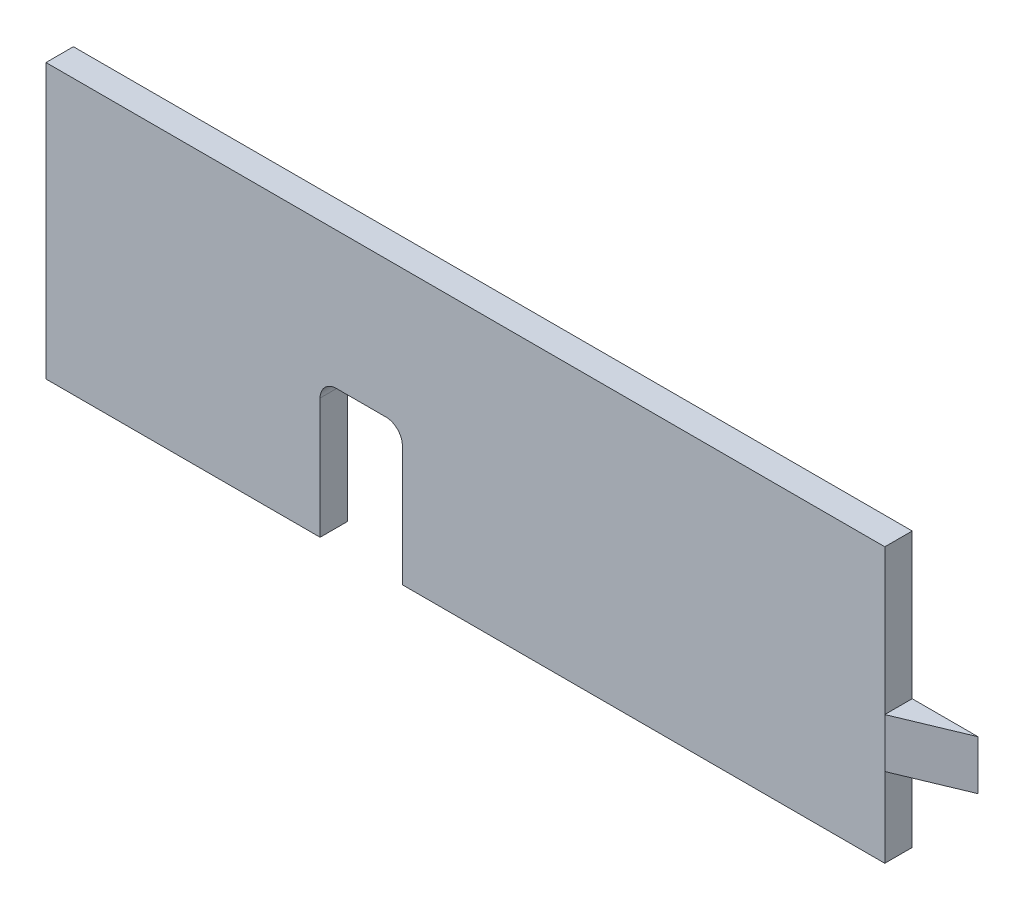
ISO-10303-21;
HEADER;
FILE_DESCRIPTION(('STEP AP214'),'2;1');
FILE_NAME('part.step','',(''),(''),'','','');
FILE_SCHEMA(('AUTOMOTIVE_DESIGN { 1 0 10303 214 1 1 1 1 }'));
ENDSEC;
DATA;
#1=APPLICATION_CONTEXT('core data for automotive mechanical design processes');
#2=APPLICATION_PROTOCOL_DEFINITION('international standard','automotive_design',2000,#1);
#3=PRODUCT_CONTEXT('',#1,'mechanical');
#4=PRODUCT('Part','Part','',(#3));
#5=PRODUCT_RELATED_PRODUCT_CATEGORY('part','',(#4));
#6=PRODUCT_DEFINITION_FORMATION('','',#4);
#7=PRODUCT_DEFINITION_CONTEXT('part definition',#1,'design');
#8=PRODUCT_DEFINITION('design','',#6,#7);
#9=PRODUCT_DEFINITION_SHAPE('','',#8);
#10=(LENGTH_UNIT() NAMED_UNIT(*) SI_UNIT(.MILLI.,.METRE.));
#11=(NAMED_UNIT(*) PLANE_ANGLE_UNIT() SI_UNIT($,.RADIAN.));
#12=(NAMED_UNIT(*) SI_UNIT($,.STERADIAN.) SOLID_ANGLE_UNIT());
#13=UNCERTAINTY_MEASURE_WITH_UNIT(LENGTH_MEASURE(1.E-05),#10,'distance_accuracy_value','');
#14=(GEOMETRIC_REPRESENTATION_CONTEXT(3) GLOBAL_UNCERTAINTY_ASSIGNED_CONTEXT((#13)) GLOBAL_UNIT_ASSIGNED_CONTEXT((#10,
#11,#12)) REPRESENTATION_CONTEXT('',''));
#15=CARTESIAN_POINT('',(0.,0.,0.));
#16=DIRECTION('',(0.,0.,1.));
#17=DIRECTION('',(1.,0.,0.));
#18=AXIS2_PLACEMENT_3D('',#15,#16,#17);
#19=CARTESIAN_POINT('',(76.5,-25.,2.5));
#20=DIRECTION('',(-1.,0.,0.));
#21=DIRECTION('',(0.,0.,1.));
#22=AXIS2_PLACEMENT_3D('',#19,#20,#21);
#23=PLANE('',#22);
#24=DIRECTION('',(0.,0.,1.));
#25=VECTOR('',#24,1.);
#26=CARTESIAN_POINT('',(76.5,-1.5,2.5));
#27=LINE('',#26,#25);
#28=CARTESIAN_POINT('',(76.5,-1.5,-2.5));
#29=VERTEX_POINT('',#28);
#30=CARTESIAN_POINT('',(76.5,-1.5,2.5));
#31=VERTEX_POINT('',#30);
#32=EDGE_CURVE('E47',#29,#31,#27,.T.);
#33=ORIENTED_EDGE('',*,*,#32,.F.);
#34=DIRECTION('',(0.,1.,0.));
#35=VECTOR('',#34,1.);
#36=CARTESIAN_POINT('',(76.5,-25.,-2.5));
#37=LINE('',#36,#35);
#38=CARTESIAN_POINT('',(76.5,25.,-2.5));
#39=VERTEX_POINT('',#38);
#40=EDGE_CURVE('E176',#29,#39,#37,.T.);
#41=ORIENTED_EDGE('',*,*,#40,.T.);
#42=DIRECTION('',(0.,0.,-1.));
#43=VECTOR('',#42,1.);
#44=CARTESIAN_POINT('',(76.5,25.,2.5));
#45=LINE('',#44,#43);
#46=CARTESIAN_POINT('',(76.5,25.,2.5));
#47=VERTEX_POINT('',#46);
#48=EDGE_CURVE('E11',#47,#39,#45,.T.);
#49=ORIENTED_EDGE('',*,*,#48,.F.);
#50=DIRECTION('',(0.,1.,0.));
#51=VECTOR('',#50,1.);
#52=CARTESIAN_POINT('',(76.5,-25.,2.5));
#53=LINE('',#52,#51);
#54=EDGE_CURVE('E160',#31,#47,#53,.T.);
#55=ORIENTED_EDGE('',*,*,#54,.F.);
#56=EDGE_LOOP('',(#33,#41,#49,#55));
#57=FACE_BOUND('',#56,.T.);
#58=ADVANCED_FACE('F33',(#57),#23,.F.);
#59=DIRECTION('',(0.,0.,-1.));
#60=VECTOR('',#59,1.);
#61=CARTESIAN_POINT('',(76.5,-10.5,2.5));
#62=LINE('',#61,#60);
#63=CARTESIAN_POINT('',(76.5,-10.5,2.5));
#64=VERTEX_POINT('',#63);
#65=CARTESIAN_POINT('',(76.5,-10.5,-2.5));
#66=VERTEX_POINT('',#65);
#67=EDGE_CURVE('E141',#64,#66,#62,.T.);
#68=ORIENTED_EDGE('',*,*,#67,.F.);
#69=CARTESIAN_POINT('',(76.5,-25.,2.5));
#70=VERTEX_POINT('',#69);
#71=EDGE_CURVE('E150',#70,#64,#53,.T.);
#72=ORIENTED_EDGE('',*,*,#71,.F.);
#73=DIRECTION('',(0.,0.,-1.));
#74=VECTOR('',#73,1.);
#75=CARTESIAN_POINT('',(76.5,-25.,2.5));
#76=LINE('',#75,#74);
#77=CARTESIAN_POINT('',(76.5,-25.,-2.5));
#78=VERTEX_POINT('',#77);
#79=EDGE_CURVE('E173',#70,#78,#76,.T.);
#80=ORIENTED_EDGE('',*,*,#79,.T.);
#81=EDGE_CURVE('E152',#78,#66,#37,.T.);
#82=ORIENTED_EDGE('',*,*,#81,.T.);
#83=EDGE_LOOP('',(#68,#72,#80,#82));
#84=FACE_BOUND('',#83,.T.);
#85=ADVANCED_FACE('F148',(#84),#23,.F.);
#86=CARTESIAN_POINT('',(-76.5,-25.,2.5));
#87=DIRECTION('',(0.,1.,0.));
#88=DIRECTION('',(0.,0.,1.));
#89=AXIS2_PLACEMENT_3D('',#86,#87,#88);
#90=PLANE('',#89);
#91=DIRECTION('',(1.,0.,0.));
#92=VECTOR('',#91,1.);
#93=CARTESIAN_POINT('',(-76.5,-25.,-2.5));
#94=LINE('',#93,#92);
#95=CARTESIAN_POINT('',(-76.5,-25.,-2.5));
#96=VERTEX_POINT('',#95);
#97=CARTESIAN_POINT('',(-26.5,-25.,-2.5));
#98=VERTEX_POINT('',#97);
#99=EDGE_CURVE('E164',#96,#98,#94,.T.);
#100=ORIENTED_EDGE('',*,*,#99,.T.);
#101=DIRECTION('',(0.,0.,1.));
#102=VECTOR('',#101,1.);
#103=CARTESIAN_POINT('',(-26.5,-25.,-2.5));
#104=LINE('',#103,#102);
#105=CARTESIAN_POINT('',(-26.5,-25.,2.5));
#106=VERTEX_POINT('',#105);
#107=EDGE_CURVE('E207',#98,#106,#104,.T.);
#108=ORIENTED_EDGE('',*,*,#107,.T.);
#109=DIRECTION('',(1.,0.,0.));
#110=VECTOR('',#109,1.);
#111=CARTESIAN_POINT('',(-76.5,-25.,2.5));
#112=LINE('',#111,#110);
#113=CARTESIAN_POINT('',(-76.5,-25.,2.5));
#114=VERTEX_POINT('',#113);
#115=EDGE_CURVE('E170',#114,#106,#112,.T.);
#116=ORIENTED_EDGE('',*,*,#115,.F.);
#117=DIRECTION('',(0.,0.,-1.));
#118=VECTOR('',#117,1.);
#119=CARTESIAN_POINT('',(-76.5,-25.,2.5));
#120=LINE('',#119,#118);
#121=EDGE_CURVE('E184',#114,#96,#120,.T.);
#122=ORIENTED_EDGE('',*,*,#121,.T.);
#123=EDGE_LOOP('',(#100,#108,#116,#122));
#124=FACE_BOUND('',#123,.T.);
#125=ADVANCED_FACE('F205',(#124),#90,.F.);
#126=CARTESIAN_POINT('',(-76.5,25.,2.5));
#127=DIRECTION('',(0.,-1.,0.));
#128=DIRECTION('',(0.,0.,-1.));
#129=AXIS2_PLACEMENT_3D('',#126,#127,#128);
#130=PLANE('',#129);
#131=DIRECTION('',(-1.,0.,0.));
#132=VECTOR('',#131,1.);
#133=CARTESIAN_POINT('',(-76.5,25.,-2.5));
#134=LINE('',#133,#132);
#135=CARTESIAN_POINT('',(-76.5,25.,-2.5));
#136=VERTEX_POINT('',#135);
#137=EDGE_CURVE('E175',#39,#136,#134,.T.);
#138=ORIENTED_EDGE('',*,*,#137,.T.);
#139=DIRECTION('',(0.,0.,-1.));
#140=VECTOR('',#139,1.);
#141=CARTESIAN_POINT('',(-76.5,25.,2.5));
#142=LINE('',#141,#140);
#143=CARTESIAN_POINT('',(-76.5,25.,2.5));
#144=VERTEX_POINT('',#143);
#145=EDGE_CURVE('E40',#144,#136,#142,.T.);
#146=ORIENTED_EDGE('',*,*,#145,.F.);
#147=DIRECTION('',(-1.,0.,0.));
#148=VECTOR('',#147,1.);
#149=CARTESIAN_POINT('',(-76.5,25.,2.5));
#150=LINE('',#149,#148);
#151=EDGE_CURVE('E159',#47,#144,#150,.T.);
#152=ORIENTED_EDGE('',*,*,#151,.F.);
#153=ORIENTED_EDGE('',*,*,#48,.T.);
#154=EDGE_LOOP('',(#138,#146,#152,#153));
#155=FACE_BOUND('',#154,.T.);
#156=ADVANCED_FACE('F212',(#155),#130,.F.);
#157=CARTESIAN_POINT('',(-76.5,-25.,2.5));
#158=DIRECTION('',(1.,0.,0.));
#159=DIRECTION('',(0.,0.,-1.));
#160=AXIS2_PLACEMENT_3D('',#157,#158,#159);
#161=PLANE('',#160);
#162=DIRECTION('',(0.,-1.,0.));
#163=VECTOR('',#162,1.);
#164=CARTESIAN_POINT('',(-76.5,-25.,-2.5));
#165=LINE('',#164,#163);
#166=EDGE_CURVE('E178',#136,#96,#165,.T.);
#167=ORIENTED_EDGE('',*,*,#166,.T.);
#168=ORIENTED_EDGE('',*,*,#121,.F.);
#169=DIRECTION('',(0.,-1.,0.));
#170=VECTOR('',#169,1.);
#171=CARTESIAN_POINT('',(-76.5,-25.,2.5));
#172=LINE('',#171,#170);
#173=EDGE_CURVE('E162',#144,#114,#172,.T.);
#174=ORIENTED_EDGE('',*,*,#173,.F.);
#175=ORIENTED_EDGE('',*,*,#145,.T.);
#176=EDGE_LOOP('',(#167,#168,#174,#175));
#177=FACE_BOUND('',#176,.T.);
#178=ADVANCED_FACE('F191',(#177),#161,.F.);
#179=CARTESIAN_POINT('',(-11.5,-25.,2.5));
#180=VERTEX_POINT('',#179);
#181=EDGE_CURVE('E157',#180,#70,#112,.T.);
#182=ORIENTED_EDGE('',*,*,#181,.F.);
#183=DIRECTION('',(0.,0.,1.));
#184=VECTOR('',#183,1.);
#185=CARTESIAN_POINT('',(-11.5,-25.,-2.5));
#186=LINE('',#185,#184);
#187=CARTESIAN_POINT('',(-11.5,-25.,-2.5));
#188=VERTEX_POINT('',#187);
#189=EDGE_CURVE('E166',#188,#180,#186,.T.);
#190=ORIENTED_EDGE('',*,*,#189,.F.);
#191=EDGE_CURVE('E180',#188,#78,#94,.T.);
#192=ORIENTED_EDGE('',*,*,#191,.T.);
#193=ORIENTED_EDGE('',*,*,#79,.F.);
#194=EDGE_LOOP('',(#182,#190,#192,#193));
#195=FACE_BOUND('',#194,.T.);
#196=ADVANCED_FACE('F277',(#195),#90,.F.);
#197=CARTESIAN_POINT('',(0.,0.,2.5));
#198=DIRECTION('',(0.,0.,-1.));
#199=DIRECTION('',(-1.,0.,0.));
#200=AXIS2_PLACEMENT_3D('',#197,#198,#199);
#201=PLANE('',#200);
#202=ORIENTED_EDGE('',*,*,#71,.T.);
#203=DIRECTION('',(0.,-1.,0.));
#204=VECTOR('',#203,1.);
#205=CARTESIAN_POINT('',(76.5,11.5,2.5));
#206=LINE('',#205,#204);
#207=EDGE_CURVE('E127',#31,#64,#206,.T.);
#208=ORIENTED_EDGE('',*,*,#207,.F.);
#209=ORIENTED_EDGE('',*,*,#54,.T.);
#210=ORIENTED_EDGE('',*,*,#151,.T.);
#211=ORIENTED_EDGE('',*,*,#173,.T.);
#212=ORIENTED_EDGE('',*,*,#115,.T.);
#213=DIRECTION('',(0.,-1.,0.));
#214=VECTOR('',#213,1.);
#215=CARTESIAN_POINT('',(-26.5,-25.,2.5));
#216=LINE('',#215,#214);
#217=CARTESIAN_POINT('',(-26.5,-3.,2.5));
#218=VERTEX_POINT('',#217);
#219=EDGE_CURVE('E210',#218,#106,#216,.T.);
#220=ORIENTED_EDGE('',*,*,#219,.F.);
#221=CARTESIAN_POINT('',(-23.5,-3.,2.5));
#222=DIRECTION('',(0.,0.,1.));
#223=DIRECTION('',(-1.,0.,0.));
#224=AXIS2_PLACEMENT_3D('',#221,#222,#223);
#225=CIRCLE('',#224,3.);
#226=CARTESIAN_POINT('',(-23.5,0.,2.5));
#227=VERTEX_POINT('',#226);
#228=EDGE_CURVE('E241',#227,#218,#225,.T.);
#229=ORIENTED_EDGE('',*,*,#228,.F.);
#230=DIRECTION('',(-1.,0.,0.));
#231=VECTOR('',#230,1.);
#232=CARTESIAN_POINT('',(-23.5,0.,2.5));
#233=LINE('',#232,#231);
#234=CARTESIAN_POINT('',(-14.5,0.,2.5));
#235=VERTEX_POINT('',#234);
#236=EDGE_CURVE('E239',#235,#227,#233,.T.);
#237=ORIENTED_EDGE('',*,*,#236,.F.);
#238=CARTESIAN_POINT('',(-14.5,-3.,2.5));
#239=DIRECTION('',(0.,0.,1.));
#240=DIRECTION('',(-1.,0.,0.));
#241=AXIS2_PLACEMENT_3D('',#238,#239,#240);
#242=CIRCLE('',#241,3.);
#243=CARTESIAN_POINT('',(-11.5,-3.,2.5));
#244=VERTEX_POINT('',#243);
#245=EDGE_CURVE('E237',#244,#235,#242,.T.);
#246=ORIENTED_EDGE('',*,*,#245,.F.);
#247=DIRECTION('',(0.,1.,0.));
#248=VECTOR('',#247,1.);
#249=CARTESIAN_POINT('',(-11.5,-3.,2.5));
#250=LINE('',#249,#248);
#251=EDGE_CURVE('E235',#180,#244,#250,.T.);
#252=ORIENTED_EDGE('',*,*,#251,.F.);
#253=ORIENTED_EDGE('',*,*,#181,.T.);
#254=EDGE_LOOP('',(#202,#208,#209,#210,#211,#212,#220,#229,#237,#246,#252,#253));
#255=FACE_BOUND('',#254,.T.);
#256=ADVANCED_FACE('F154',(#255),#201,.F.);
#257=CARTESIAN_POINT('',(0.,0.,-2.5));
#258=DIRECTION('',(0.,0.,-1.));
#259=DIRECTION('',(-1.,0.,0.));
#260=AXIS2_PLACEMENT_3D('',#257,#258,#259);
#261=PLANE('',#260);
#262=DIRECTION('',(0.,-1.,0.));
#263=VECTOR('',#262,1.);
#264=CARTESIAN_POINT('',(-26.5,-25.,-2.5));
#265=LINE('',#264,#263);
#266=CARTESIAN_POINT('',(-26.5,-3.,-2.5));
#267=VERTEX_POINT('',#266);
#268=EDGE_CURVE('E202',#267,#98,#265,.T.);
#269=ORIENTED_EDGE('',*,*,#268,.T.);
#270=ORIENTED_EDGE('',*,*,#99,.F.);
#271=ORIENTED_EDGE('',*,*,#166,.F.);
#272=ORIENTED_EDGE('',*,*,#137,.F.);
#273=ORIENTED_EDGE('',*,*,#40,.F.);
#274=DIRECTION('',(-1.,0.,0.));
#275=VECTOR('',#274,1.);
#276=CARTESIAN_POINT('',(88.5,-1.5,-2.5));
#277=LINE('',#276,#275);
#278=CARTESIAN_POINT('',(88.5,-1.5,-2.5));
#279=VERTEX_POINT('',#278);
#280=EDGE_CURVE('E290',#279,#29,#277,.T.);
#281=ORIENTED_EDGE('',*,*,#280,.F.);
#282=DIRECTION('',(0.,1.,0.));
#283=VECTOR('',#282,1.);
#284=CARTESIAN_POINT('',(88.5,-10.5,-2.5));
#285=LINE('',#284,#283);
#286=CARTESIAN_POINT('',(88.5,-10.5,-2.5));
#287=VERTEX_POINT('',#286);
#288=EDGE_CURVE('E289',#287,#279,#285,.T.);
#289=ORIENTED_EDGE('',*,*,#288,.F.);
#290=DIRECTION('',(-1.,0.,0.));
#291=VECTOR('',#290,1.);
#292=CARTESIAN_POINT('',(88.5,-10.5,-2.5));
#293=LINE('',#292,#291);
#294=EDGE_CURVE('E143',#287,#66,#293,.T.);
#295=ORIENTED_EDGE('',*,*,#294,.T.);
#296=ORIENTED_EDGE('',*,*,#81,.F.);
#297=ORIENTED_EDGE('',*,*,#191,.F.);
#298=DIRECTION('',(0.,1.,0.));
#299=VECTOR('',#298,1.);
#300=CARTESIAN_POINT('',(-11.5,-3.,-2.5));
#301=LINE('',#300,#299);
#302=CARTESIAN_POINT('',(-11.5,-3.,-2.5));
#303=VERTEX_POINT('',#302);
#304=EDGE_CURVE('E244',#188,#303,#301,.T.);
#305=ORIENTED_EDGE('',*,*,#304,.T.);
#306=CARTESIAN_POINT('',(-14.5,-3.,-2.5));
#307=DIRECTION('',(0.,0.,1.));
#308=DIRECTION('',(-1.,0.,0.));
#309=AXIS2_PLACEMENT_3D('',#306,#307,#308);
#310=CIRCLE('',#309,3.);
#311=CARTESIAN_POINT('',(-14.5,0.,-2.5));
#312=VERTEX_POINT('',#311);
#313=EDGE_CURVE('E55',#303,#312,#310,.T.);
#314=ORIENTED_EDGE('',*,*,#313,.T.);
#315=DIRECTION('',(-1.,0.,0.));
#316=VECTOR('',#315,1.);
#317=CARTESIAN_POINT('',(-23.5,0.,-2.5));
#318=LINE('',#317,#316);
#319=CARTESIAN_POINT('',(-23.5,0.,-2.5));
#320=VERTEX_POINT('',#319);
#321=EDGE_CURVE('E231',#312,#320,#318,.T.);
#322=ORIENTED_EDGE('',*,*,#321,.T.);
#323=CARTESIAN_POINT('',(-23.5,-3.,-2.5));
#324=DIRECTION('',(0.,0.,1.));
#325=DIRECTION('',(-1.,0.,0.));
#326=AXIS2_PLACEMENT_3D('',#323,#324,#325);
#327=CIRCLE('',#326,3.);
#328=EDGE_CURVE('E229',#320,#267,#327,.T.);
#329=ORIENTED_EDGE('',*,*,#328,.T.);
#330=EDGE_LOOP('',(#269,#270,#271,#272,#273,#281,#289,#295,#296,#297,#305,#314,#322,#329));
#331=FACE_BOUND('',#330,.T.);
#332=ADVANCED_FACE('F199',(#331),#261,.T.);
#333=CARTESIAN_POINT('',(-26.5,-25.,-2.5));
#334=DIRECTION('',(-1.,0.,0.));
#335=DIRECTION('',(0.,0.,1.));
#336=AXIS2_PLACEMENT_3D('',#333,#334,#335);
#337=PLANE('',#336);
#338=ORIENTED_EDGE('',*,*,#219,.T.);
#339=ORIENTED_EDGE('',*,*,#107,.F.);
#340=ORIENTED_EDGE('',*,*,#268,.F.);
#341=DIRECTION('',(0.,0.,1.));
#342=VECTOR('',#341,1.);
#343=CARTESIAN_POINT('',(-26.5,-3.,-2.5));
#344=LINE('',#343,#342);
#345=EDGE_CURVE('E215',#267,#218,#344,.T.);
#346=ORIENTED_EDGE('',*,*,#345,.T.);
#347=EDGE_LOOP('',(#338,#339,#340,#346));
#348=FACE_BOUND('',#347,.T.);
#349=ADVANCED_FACE('F259',(#348),#337,.F.);
#350=CARTESIAN_POINT('',(-23.5,-3.,-2.5));
#351=DIRECTION('',(0.,0.,1.));
#352=DIRECTION('',(1.,0.,0.));
#353=AXIS2_PLACEMENT_3D('',#350,#351,#352);
#354=CYLINDRICAL_SURFACE('',#353,3.);
#355=ORIENTED_EDGE('',*,*,#228,.T.);
#356=ORIENTED_EDGE('',*,*,#345,.F.);
#357=ORIENTED_EDGE('',*,*,#328,.F.);
#358=DIRECTION('',(0.,0.,1.));
#359=VECTOR('',#358,1.);
#360=CARTESIAN_POINT('',(-23.5,0.,-2.5));
#361=LINE('',#360,#359);
#362=EDGE_CURVE('E217',#320,#227,#361,.T.);
#363=ORIENTED_EDGE('',*,*,#362,.T.);
#364=EDGE_LOOP('',(#355,#356,#357,#363));
#365=FACE_BOUND('',#364,.T.);
#366=ADVANCED_FACE('F258',(#365),#354,.F.);
#367=CARTESIAN_POINT('',(-23.5,0.,-2.5));
#368=DIRECTION('',(0.,1.,0.));
#369=DIRECTION('',(0.,0.,1.));
#370=AXIS2_PLACEMENT_3D('',#367,#368,#369);
#371=PLANE('',#370);
#372=ORIENTED_EDGE('',*,*,#236,.T.);
#373=ORIENTED_EDGE('',*,*,#362,.F.);
#374=ORIENTED_EDGE('',*,*,#321,.F.);
#375=DIRECTION('',(0.,0.,1.));
#376=VECTOR('',#375,1.);
#377=CARTESIAN_POINT('',(-14.5,0.,-2.5));
#378=LINE('',#377,#376);
#379=EDGE_CURVE('E223',#312,#235,#378,.T.);
#380=ORIENTED_EDGE('',*,*,#379,.T.);
#381=EDGE_LOOP('',(#372,#373,#374,#380));
#382=FACE_BOUND('',#381,.T.);
#383=ADVANCED_FACE('F256',(#382),#371,.F.);
#384=CARTESIAN_POINT('',(-14.5,-3.,-2.5));
#385=DIRECTION('',(0.,0.,1.));
#386=DIRECTION('',(1.,0.,0.));
#387=AXIS2_PLACEMENT_3D('',#384,#385,#386);
#388=CYLINDRICAL_SURFACE('',#387,3.);
#389=ORIENTED_EDGE('',*,*,#245,.T.);
#390=ORIENTED_EDGE('',*,*,#379,.F.);
#391=ORIENTED_EDGE('',*,*,#313,.F.);
#392=DIRECTION('',(0.,0.,1.));
#393=VECTOR('',#392,1.);
#394=CARTESIAN_POINT('',(-11.5,-3.,-2.5));
#395=LINE('',#394,#393);
#396=EDGE_CURVE('E224',#303,#244,#395,.T.);
#397=ORIENTED_EDGE('',*,*,#396,.T.);
#398=EDGE_LOOP('',(#389,#390,#391,#397));
#399=FACE_BOUND('',#398,.T.);
#400=ADVANCED_FACE('F307',(#399),#388,.F.);
#401=CARTESIAN_POINT('',(-11.5,-3.,-2.5));
#402=DIRECTION('',(1.,0.,0.));
#403=DIRECTION('',(0.,0.,-1.));
#404=AXIS2_PLACEMENT_3D('',#401,#402,#403);
#405=PLANE('',#404);
#406=ORIENTED_EDGE('',*,*,#251,.T.);
#407=ORIENTED_EDGE('',*,*,#396,.F.);
#408=ORIENTED_EDGE('',*,*,#304,.F.);
#409=ORIENTED_EDGE('',*,*,#189,.T.);
#410=EDGE_LOOP('',(#406,#407,#408,#409));
#411=FACE_BOUND('',#410,.T.);
#412=ADVANCED_FACE('F303',(#411),#405,.F.);
#413=CARTESIAN_POINT('',(88.5,-10.5,2.5));
#414=DIRECTION('',(0.,1.,0.));
#415=DIRECTION('',(0.,0.,1.));
#416=AXIS2_PLACEMENT_3D('',#413,#414,#415);
#417=PLANE('',#416);
#418=ORIENTED_EDGE('',*,*,#294,.F.);
#419=DIRECTION('',(0.923076923076923,0.,-0.384615384615385));
#420=VECTOR('',#419,1.);
#421=CARTESIAN_POINT('',(76.5,-10.5,2.5));
#422=LINE('',#421,#420);
#423=EDGE_CURVE('E130',#64,#287,#422,.T.);
#424=ORIENTED_EDGE('',*,*,#423,.F.);
#425=ORIENTED_EDGE('',*,*,#67,.T.);
#426=EDGE_LOOP('',(#418,#424,#425));
#427=FACE_BOUND('',#426,.T.);
#428=ADVANCED_FACE('F140',(#427),#417,.F.);
#429=CARTESIAN_POINT('',(88.5,-1.5,2.5));
#430=DIRECTION('',(0.,-1.,0.));
#431=DIRECTION('',(0.,0.,-1.));
#432=AXIS2_PLACEMENT_3D('',#429,#430,#431);
#433=PLANE('',#432);
#434=ORIENTED_EDGE('',*,*,#32,.T.);
#435=DIRECTION('',(-0.923076923076923,0.,0.384615384615385));
#436=VECTOR('',#435,1.);
#437=CARTESIAN_POINT('',(76.5,-1.5,2.5));
#438=LINE('',#437,#436);
#439=EDGE_CURVE('E133',#279,#31,#438,.T.);
#440=ORIENTED_EDGE('',*,*,#439,.F.);
#441=ORIENTED_EDGE('',*,*,#280,.T.);
#442=EDGE_LOOP('',(#434,#440,#441));
#443=FACE_BOUND('',#442,.T.);
#444=ADVANCED_FACE('F295',(#443),#433,.F.);
#445=CARTESIAN_POINT('',(76.5,11.5,2.5));
#446=DIRECTION('',(-0.384615384615385,0.,-0.923076923076923));
#447=DIRECTION('',(-0.923076923076923,0.,0.384615384615385));
#448=AXIS2_PLACEMENT_3D('',#445,#446,#447);
#449=PLANE('',#448);
#450=ORIENTED_EDGE('',*,*,#439,.T.);
#451=ORIENTED_EDGE('',*,*,#207,.T.);
#452=ORIENTED_EDGE('',*,*,#423,.T.);
#453=ORIENTED_EDGE('',*,*,#288,.T.);
#454=EDGE_LOOP('',(#450,#451,#452,#453));
#455=FACE_BOUND('',#454,.T.);
#456=ADVANCED_FACE('F129',(#455),#449,.F.);
#457=CLOSED_SHELL('',(#58,#85,#125,#156,#178,#196,#256,#332,#349,#366,#383,#400,#412,#428,#444,#456));
#458=MANIFOLD_SOLID_BREP('B2',#457);
#459=ADVANCED_BREP_SHAPE_REPRESENTATION('',(#18,#458),#14);
#460=SHAPE_DEFINITION_REPRESENTATION(#9,#459);
ENDSEC;
END-ISO-10303-21;
